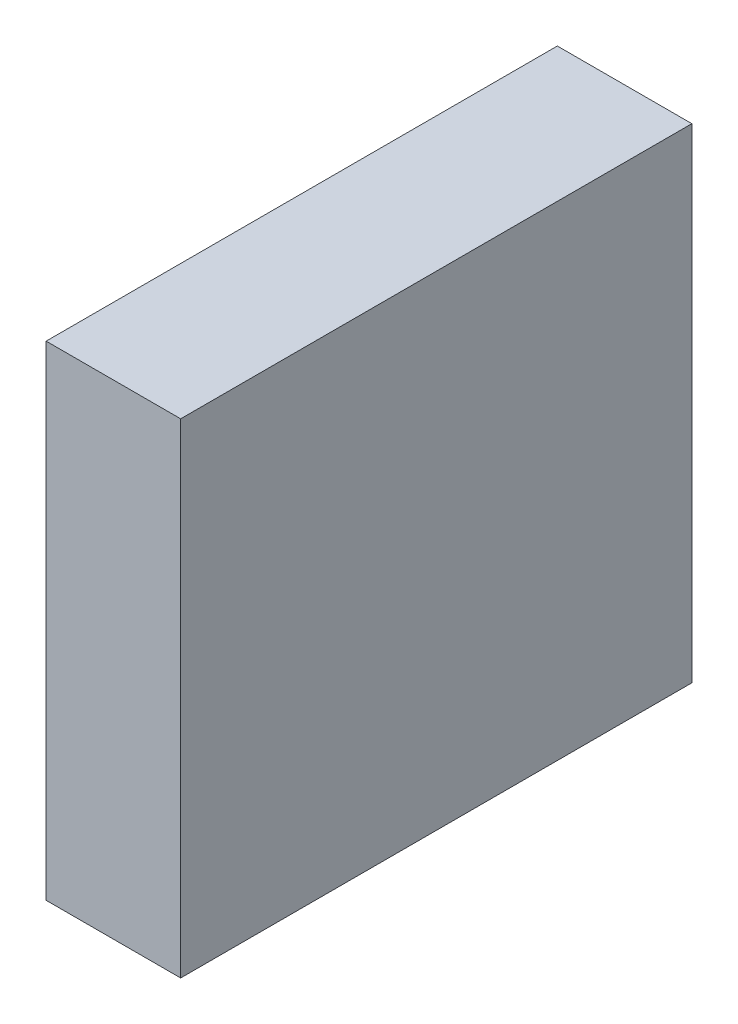
ISO-10303-21;
HEADER;
FILE_DESCRIPTION(('STEP AP214'),'2;1');
FILE_NAME('part.step','',(''),(''),'','','');
FILE_SCHEMA(('AUTOMOTIVE_DESIGN { 1 0 10303 214 1 1 1 1 }'));
ENDSEC;
DATA;
#1=APPLICATION_CONTEXT('core data for automotive mechanical design processes');
#2=APPLICATION_PROTOCOL_DEFINITION('international standard','automotive_design',2000,#1);
#3=PRODUCT_CONTEXT('',#1,'mechanical');
#4=PRODUCT('Part','Part','',(#3));
#5=PRODUCT_RELATED_PRODUCT_CATEGORY('part','',(#4));
#6=PRODUCT_DEFINITION_FORMATION('','',#4);
#7=PRODUCT_DEFINITION_CONTEXT('part definition',#1,'design');
#8=PRODUCT_DEFINITION('design','',#6,#7);
#9=PRODUCT_DEFINITION_SHAPE('','',#8);
#10=(LENGTH_UNIT() NAMED_UNIT(*) SI_UNIT(.MILLI.,.METRE.));
#11=(NAMED_UNIT(*) PLANE_ANGLE_UNIT() SI_UNIT($,.RADIAN.));
#12=(NAMED_UNIT(*) SI_UNIT($,.STERADIAN.) SOLID_ANGLE_UNIT());
#13=UNCERTAINTY_MEASURE_WITH_UNIT(LENGTH_MEASURE(1.E-05),#10,'distance_accuracy_value','');
#14=(GEOMETRIC_REPRESENTATION_CONTEXT(3) GLOBAL_UNCERTAINTY_ASSIGNED_CONTEXT((#13)) GLOBAL_UNIT_ASSIGNED_CONTEXT((#10,
#11,#12)) REPRESENTATION_CONTEXT('',''));
#15=CARTESIAN_POINT('',(0.,0.,0.));
#16=DIRECTION('',(0.,0.,1.));
#17=DIRECTION('',(1.,0.,0.));
#18=AXIS2_PLACEMENT_3D('',#15,#16,#17);
#19=CARTESIAN_POINT('',(-0.2499995,0.90000074,0.));
#20=DIRECTION('',(1.,0.,0.));
#21=DIRECTION('',(0.,-1.,0.));
#22=AXIS2_PLACEMENT_3D('',#19,#20,#21);
#23=PLANE('',#22);
#24=DIRECTION('',(0.,-1.,0.));
#25=VECTOR('',#24,1.);
#26=CARTESIAN_POINT('',(-0.2499995,0.90000074,0.));
#27=LINE('',#26,#25);
#28=CARTESIAN_POINT('',(-0.2499995,0.90000074,0.));
#29=VERTEX_POINT('',#28);
#30=CARTESIAN_POINT('',(-0.2499995,-0.8999982,0.));
#31=VERTEX_POINT('',#30);
#32=EDGE_CURVE('E11',#29,#31,#27,.T.);
#33=ORIENTED_EDGE('',*,*,#32,.T.);
#34=DIRECTION('',(0.,0.,1.));
#35=VECTOR('',#34,1.);
#36=CARTESIAN_POINT('',(-0.2499995,-0.8999982,0.));
#37=LINE('',#36,#35);
#38=CARTESIAN_POINT('',(-0.2499995,-0.8999982,1.89999874));
#39=VERTEX_POINT('',#38);
#40=EDGE_CURVE('E23',#31,#39,#37,.T.);
#41=ORIENTED_EDGE('',*,*,#40,.T.);
#42=DIRECTION('',(0.,-1.,0.));
#43=VECTOR('',#42,1.);
#44=CARTESIAN_POINT('',(-0.2499995,0.90000074,1.89999874));
#45=LINE('',#44,#43);
#46=CARTESIAN_POINT('',(-0.2499995,0.90000074,1.89999874));
#47=VERTEX_POINT('',#46);
#48=EDGE_CURVE('E86',#47,#39,#45,.T.);
#49=ORIENTED_EDGE('',*,*,#48,.F.);
#50=DIRECTION('',(0.,0.,1.));
#51=VECTOR('',#50,1.);
#52=CARTESIAN_POINT('',(-0.2499995,0.90000074,0.));
#53=LINE('',#52,#51);
#54=EDGE_CURVE('E35',#29,#47,#53,.T.);
#55=ORIENTED_EDGE('',*,*,#54,.F.);
#56=EDGE_LOOP('',(#33,#41,#49,#55));
#57=FACE_BOUND('',#56,.T.);
#58=ADVANCED_FACE('F16',(#57),#23,.F.);
#59=CARTESIAN_POINT('',(-0.2499995,-0.8999982,0.));
#60=DIRECTION('',(0.,1.,0.));
#61=DIRECTION('',(1.,0.,0.));
#62=AXIS2_PLACEMENT_3D('',#59,#60,#61);
#63=PLANE('',#62);
#64=DIRECTION('',(1.,0.,0.));
#65=VECTOR('',#64,1.);
#66=CARTESIAN_POINT('',(-0.2499995,-0.8999982,0.));
#67=LINE('',#66,#65);
#68=CARTESIAN_POINT('',(0.2499995,-0.8999982,0.));
#69=VERTEX_POINT('',#68);
#70=EDGE_CURVE('E83',#31,#69,#67,.T.);
#71=ORIENTED_EDGE('',*,*,#70,.T.);
#72=DIRECTION('',(0.,0.,1.));
#73=VECTOR('',#72,1.);
#74=CARTESIAN_POINT('',(0.2499995,-0.8999982,0.));
#75=LINE('',#74,#73);
#76=CARTESIAN_POINT('',(0.2499995,-0.8999982,1.89999874));
#77=VERTEX_POINT('',#76);
#78=EDGE_CURVE('E81',#69,#77,#75,.T.);
#79=ORIENTED_EDGE('',*,*,#78,.T.);
#80=DIRECTION('',(1.,0.,0.));
#81=VECTOR('',#80,1.);
#82=CARTESIAN_POINT('',(-0.2499995,-0.8999982,1.89999874));
#83=LINE('',#82,#81);
#84=EDGE_CURVE('E61',#39,#77,#83,.T.);
#85=ORIENTED_EDGE('',*,*,#84,.F.);
#86=ORIENTED_EDGE('',*,*,#40,.F.);
#87=EDGE_LOOP('',(#71,#79,#85,#86));
#88=FACE_BOUND('',#87,.T.);
#89=ADVANCED_FACE('F88',(#88),#63,.F.);
#90=CARTESIAN_POINT('',(0.2499995,-0.8999982,0.));
#91=DIRECTION('',(-1.,0.,0.));
#92=DIRECTION('',(0.,1.,0.));
#93=AXIS2_PLACEMENT_3D('',#90,#91,#92);
#94=PLANE('',#93);
#95=DIRECTION('',(0.,1.,0.));
#96=VECTOR('',#95,1.);
#97=CARTESIAN_POINT('',(0.2499995,-0.8999982,0.));
#98=LINE('',#97,#96);
#99=CARTESIAN_POINT('',(0.2499995,0.90000074,0.));
#100=VERTEX_POINT('',#99);
#101=EDGE_CURVE('E70',#69,#100,#98,.T.);
#102=ORIENTED_EDGE('',*,*,#101,.T.);
#103=DIRECTION('',(0.,0.,1.));
#104=VECTOR('',#103,1.);
#105=CARTESIAN_POINT('',(0.2499995,0.90000074,0.));
#106=LINE('',#105,#104);
#107=CARTESIAN_POINT('',(0.2499995,0.90000074,1.89999874));
#108=VERTEX_POINT('',#107);
#109=EDGE_CURVE('E64',#100,#108,#106,.T.);
#110=ORIENTED_EDGE('',*,*,#109,.T.);
#111=DIRECTION('',(0.,1.,0.));
#112=VECTOR('',#111,1.);
#113=CARTESIAN_POINT('',(0.2499995,-0.8999982,1.89999874));
#114=LINE('',#113,#112);
#115=EDGE_CURVE('E56',#77,#108,#114,.T.);
#116=ORIENTED_EDGE('',*,*,#115,.F.);
#117=ORIENTED_EDGE('',*,*,#78,.F.);
#118=EDGE_LOOP('',(#102,#110,#116,#117));
#119=FACE_BOUND('',#118,.T.);
#120=ADVANCED_FACE('F68',(#119),#94,.F.);
#121=CARTESIAN_POINT('',(0.2499995,0.90000074,0.));
#122=DIRECTION('',(0.,-1.,0.));
#123=DIRECTION('',(-1.,0.,0.));
#124=AXIS2_PLACEMENT_3D('',#121,#122,#123);
#125=PLANE('',#124);
#126=DIRECTION('',(-1.,0.,0.));
#127=VECTOR('',#126,1.);
#128=CARTESIAN_POINT('',(0.2499995,0.90000074,0.));
#129=LINE('',#128,#127);
#130=EDGE_CURVE('E65',#100,#29,#129,.T.);
#131=ORIENTED_EDGE('',*,*,#130,.T.);
#132=ORIENTED_EDGE('',*,*,#54,.T.);
#133=DIRECTION('',(-1.,0.,0.));
#134=VECTOR('',#133,1.);
#135=CARTESIAN_POINT('',(0.2499995,0.90000074,1.89999874));
#136=LINE('',#135,#134);
#137=EDGE_CURVE('E60',#108,#47,#136,.T.);
#138=ORIENTED_EDGE('',*,*,#137,.F.);
#139=ORIENTED_EDGE('',*,*,#109,.F.);
#140=EDGE_LOOP('',(#131,#132,#138,#139));
#141=FACE_BOUND('',#140,.T.);
#142=ADVANCED_FACE('F75',(#141),#125,.F.);
#143=CARTESIAN_POINT('',(-0.2499995,0.90000074,0.));
#144=DIRECTION('',(0.,0.,-1.));
#145=DIRECTION('',(-1.,0.,0.));
#146=AXIS2_PLACEMENT_3D('',#143,#144,#145);
#147=PLANE('',#146);
#148=ORIENTED_EDGE('',*,*,#130,.F.);
#149=ORIENTED_EDGE('',*,*,#101,.F.);
#150=ORIENTED_EDGE('',*,*,#70,.F.);
#151=ORIENTED_EDGE('',*,*,#32,.F.);
#152=EDGE_LOOP('',(#148,#149,#150,#151));
#153=FACE_BOUND('',#152,.T.);
#154=ADVANCED_FACE('F90',(#153),#147,.T.);
#155=CARTESIAN_POINT('',(-0.2499995,0.90000074,1.89999874));
#156=DIRECTION('',(0.,0.,-1.));
#157=DIRECTION('',(-1.,0.,0.));
#158=AXIS2_PLACEMENT_3D('',#155,#156,#157);
#159=PLANE('',#158);
#160=ORIENTED_EDGE('',*,*,#48,.T.);
#161=ORIENTED_EDGE('',*,*,#84,.T.);
#162=ORIENTED_EDGE('',*,*,#115,.T.);
#163=ORIENTED_EDGE('',*,*,#137,.T.);
#164=EDGE_LOOP('',(#160,#161,#162,#163));
#165=FACE_BOUND('',#164,.T.);
#166=ADVANCED_FACE('F58',(#165),#159,.F.);
#167=CLOSED_SHELL('',(#58,#89,#120,#142,#154,#166));
#168=MANIFOLD_SOLID_BREP('B1',#167);
#169=ADVANCED_BREP_SHAPE_REPRESENTATION('',(#18,#168),#14);
#170=SHAPE_DEFINITION_REPRESENTATION(#9,#169);
ENDSEC;
END-ISO-10303-21;
